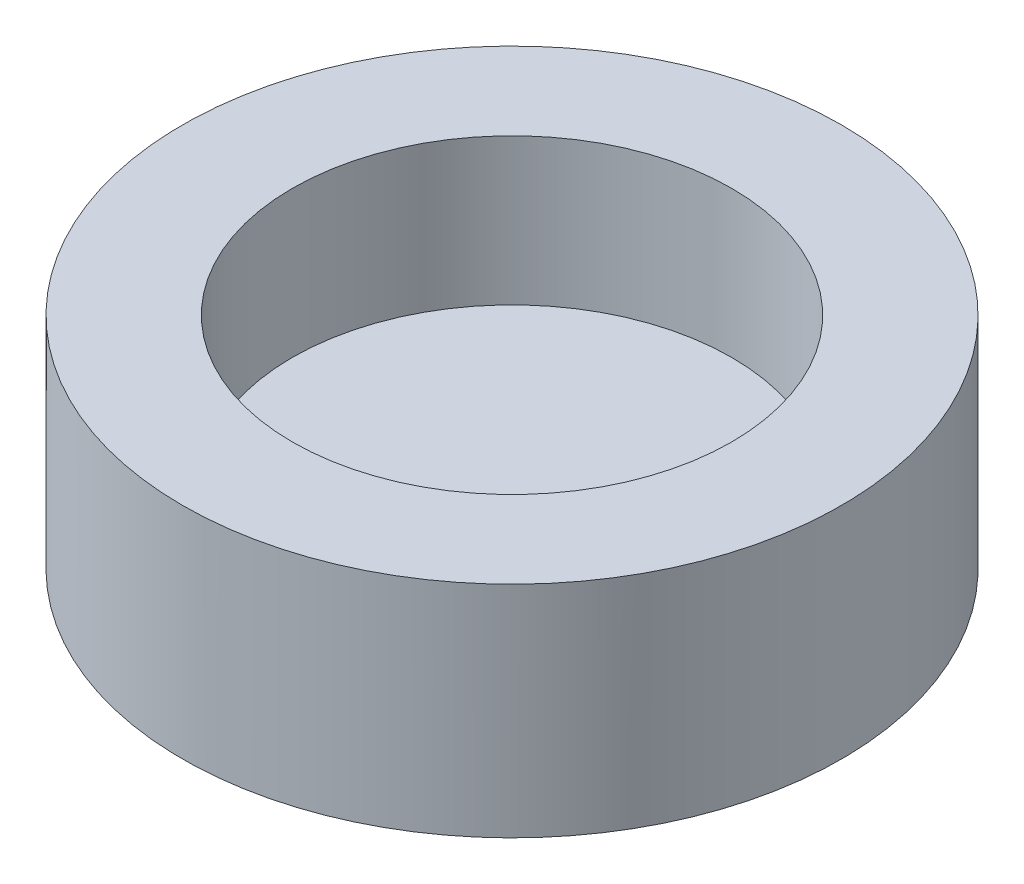
ISO-10303-21;
HEADER;
FILE_DESCRIPTION(('STEP AP214'),'2;1');
FILE_NAME('part.step','',(''),(''),'','','');
FILE_SCHEMA(('AUTOMOTIVE_DESIGN { 1 0 10303 214 1 1 1 1 }'));
ENDSEC;
DATA;
#1=APPLICATION_CONTEXT('core data for automotive mechanical design processes');
#2=APPLICATION_PROTOCOL_DEFINITION('international standard','automotive_design',2000,#1);
#3=PRODUCT_CONTEXT('',#1,'mechanical');
#4=PRODUCT('Part','Part','',(#3));
#5=PRODUCT_RELATED_PRODUCT_CATEGORY('part','',(#4));
#6=PRODUCT_DEFINITION_FORMATION('','',#4);
#7=PRODUCT_DEFINITION_CONTEXT('part definition',#1,'design');
#8=PRODUCT_DEFINITION('design','',#6,#7);
#9=PRODUCT_DEFINITION_SHAPE('','',#8);
#10=(LENGTH_UNIT() NAMED_UNIT(*) SI_UNIT(.MILLI.,.METRE.));
#11=(NAMED_UNIT(*) PLANE_ANGLE_UNIT() SI_UNIT($,.RADIAN.));
#12=(NAMED_UNIT(*) SI_UNIT($,.STERADIAN.) SOLID_ANGLE_UNIT());
#13=UNCERTAINTY_MEASURE_WITH_UNIT(LENGTH_MEASURE(1.E-05),#10,'distance_accuracy_value','');
#14=(GEOMETRIC_REPRESENTATION_CONTEXT(3) GLOBAL_UNCERTAINTY_ASSIGNED_CONTEXT((#13)) GLOBAL_UNIT_ASSIGNED_CONTEXT((#10,
#11,#12)) REPRESENTATION_CONTEXT('',''));
#15=CARTESIAN_POINT('',(0.,0.,0.));
#16=DIRECTION('',(0.,0.,1.));
#17=DIRECTION('',(1.,0.,0.));
#18=AXIS2_PLACEMENT_3D('',#15,#16,#17);
#19=CARTESIAN_POINT('',(0.,10.,0.));
#20=DIRECTION('',(0.,1.,0.));
#21=DIRECTION('',(0.,0.,1.));
#22=AXIS2_PLACEMENT_3D('',#19,#20,#21);
#23=PLANE('',#22);
#24=CARTESIAN_POINT('',(0.,10.,0.));
#25=DIRECTION('',(0.,1.,0.));
#26=DIRECTION('',(0.,0.,1.));
#27=AXIS2_PLACEMENT_3D('',#24,#25,#26);
#28=CIRCLE('',#27,22.5);
#29=CARTESIAN_POINT('',(0.,10.,22.5));
#30=VERTEX_POINT('',#29);
#31=EDGE_CURVE('E10',#30,#30,#28,.T.);
#32=ORIENTED_EDGE('',*,*,#31,.T.);
#33=EDGE_LOOP('',(#32));
#34=FACE_BOUND('',#33,.T.);
#35=CARTESIAN_POINT('',(0.,10.,0.));
#36=DIRECTION('',(0.,1.,0.));
#37=DIRECTION('',(0.,0.,1.));
#38=AXIS2_PLACEMENT_3D('',#35,#36,#37);
#39=CIRCLE('',#38,15.);
#40=CARTESIAN_POINT('',(0.,10.,15.));
#41=VERTEX_POINT('',#40);
#42=EDGE_CURVE('E38',#41,#41,#39,.T.);
#43=ORIENTED_EDGE('',*,*,#42,.F.);
#44=EDGE_LOOP('',(#43));
#45=FACE_BOUND('',#44,.T.);
#46=ADVANCED_FACE('F31',(#34,#45),#23,.T.);
#47=CARTESIAN_POINT('',(0.,10.,0.));
#48=DIRECTION('',(0.,-1.,0.));
#49=DIRECTION('',(0.,0.,-1.));
#50=AXIS2_PLACEMENT_3D('',#47,#48,#49);
#51=CYLINDRICAL_SURFACE('',#50,22.5);
#52=ORIENTED_EDGE('',*,*,#31,.F.);
#53=EDGE_LOOP('',(#52));
#54=FACE_BOUND('',#53,.T.);
#55=CARTESIAN_POINT('',(0.,-5.,0.));
#56=DIRECTION('',(0.,-1.,0.));
#57=DIRECTION('',(0.,0.,-1.));
#58=AXIS2_PLACEMENT_3D('',#55,#56,#57);
#59=CIRCLE('',#58,22.5);
#60=CARTESIAN_POINT('',(0.,-5.,-22.5));
#61=VERTEX_POINT('',#60);
#62=EDGE_CURVE('E47',#61,#61,#59,.T.);
#63=ORIENTED_EDGE('',*,*,#62,.F.);
#64=EDGE_LOOP('',(#63));
#65=FACE_BOUND('',#64,.T.);
#66=ADVANCED_FACE('F33',(#54,#65),#51,.T.);
#67=CARTESIAN_POINT('',(0.,10.,0.));
#68=DIRECTION('',(0.,-1.,0.));
#69=DIRECTION('',(0.,0.,-1.));
#70=AXIS2_PLACEMENT_3D('',#67,#68,#69);
#71=CYLINDRICAL_SURFACE('',#70,15.);
#72=ORIENTED_EDGE('',*,*,#42,.T.);
#73=EDGE_LOOP('',(#72));
#74=FACE_BOUND('',#73,.T.);
#75=CARTESIAN_POINT('',(0.,0.,0.));
#76=DIRECTION('',(0.,1.,0.));
#77=DIRECTION('',(0.,0.,1.));
#78=AXIS2_PLACEMENT_3D('',#75,#76,#77);
#79=CIRCLE('',#78,15.);
#80=CARTESIAN_POINT('',(0.,0.,15.));
#81=VERTEX_POINT('',#80);
#82=EDGE_CURVE('E42',#81,#81,#79,.T.);
#83=ORIENTED_EDGE('',*,*,#82,.F.);
#84=EDGE_LOOP('',(#83));
#85=FACE_BOUND('',#84,.T.);
#86=ADVANCED_FACE('F55',(#74,#85),#71,.F.);
#87=CARTESIAN_POINT('',(0.,0.,0.));
#88=DIRECTION('',(0.,-1.,0.));
#89=DIRECTION('',(0.,0.,-1.));
#90=AXIS2_PLACEMENT_3D('',#87,#88,#89);
#91=PLANE('',#90);
#92=ORIENTED_EDGE('',*,*,#82,.T.);
#93=EDGE_LOOP('',(#92));
#94=FACE_BOUND('',#93,.T.);
#95=ADVANCED_FACE('F61',(#94),#91,.F.);
#96=CARTESIAN_POINT('',(0.,-5.,0.));
#97=DIRECTION('',(0.,-1.,0.));
#98=DIRECTION('',(0.,0.,-1.));
#99=AXIS2_PLACEMENT_3D('',#96,#97,#98);
#100=PLANE('',#99);
#101=ORIENTED_EDGE('',*,*,#62,.T.);
#102=EDGE_LOOP('',(#101));
#103=FACE_BOUND('',#102,.T.);
#104=ADVANCED_FACE('F52',(#103),#100,.T.);
#105=CLOSED_SHELL('',(#46,#66,#86,#95,#104));
#106=MANIFOLD_SOLID_BREP('B2',#105);
#107=ADVANCED_BREP_SHAPE_REPRESENTATION('',(#18,#106),#14);
#108=SHAPE_DEFINITION_REPRESENTATION(#9,#107);
ENDSEC;
END-ISO-10303-21;
